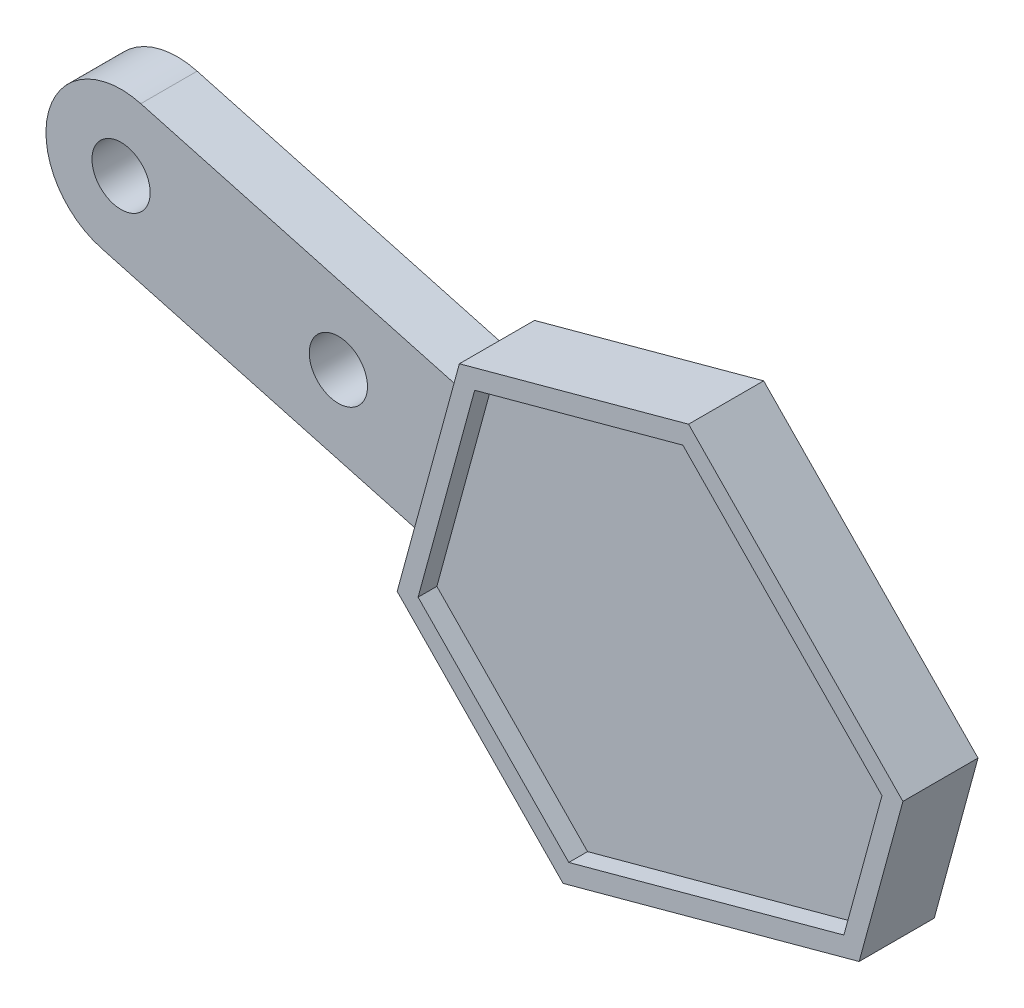
ISO-10303-21;
HEADER;
FILE_DESCRIPTION(('STEP AP214'),'2;1');
FILE_NAME('part.step','',(''),(''),'','','');
FILE_SCHEMA(('AUTOMOTIVE_DESIGN { 1 0 10303 214 1 1 1 1 }'));
ENDSEC;
DATA;
#1=APPLICATION_CONTEXT('core data for automotive mechanical design processes');
#2=APPLICATION_PROTOCOL_DEFINITION('international standard','automotive_design',2000,#1);
#3=PRODUCT_CONTEXT('',#1,'mechanical');
#4=PRODUCT('Part','Part','',(#3));
#5=PRODUCT_RELATED_PRODUCT_CATEGORY('part','',(#4));
#6=PRODUCT_DEFINITION_FORMATION('','',#4);
#7=PRODUCT_DEFINITION_CONTEXT('part definition',#1,'design');
#8=PRODUCT_DEFINITION('design','',#6,#7);
#9=PRODUCT_DEFINITION_SHAPE('','',#8);
#10=(LENGTH_UNIT() NAMED_UNIT(*) SI_UNIT(.MILLI.,.METRE.));
#11=(NAMED_UNIT(*) PLANE_ANGLE_UNIT() SI_UNIT($,.RADIAN.));
#12=(NAMED_UNIT(*) SI_UNIT($,.STERADIAN.) SOLID_ANGLE_UNIT());
#13=UNCERTAINTY_MEASURE_WITH_UNIT(LENGTH_MEASURE(1.E-05),#10,'distance_accuracy_value','');
#14=(GEOMETRIC_REPRESENTATION_CONTEXT(3) GLOBAL_UNCERTAINTY_ASSIGNED_CONTEXT((#13)) GLOBAL_UNIT_ASSIGNED_CONTEXT((#10,
#11,#12)) REPRESENTATION_CONTEXT('',''));
#15=CARTESIAN_POINT('',(0.,0.,0.));
#16=DIRECTION('',(0.,0.,1.));
#17=DIRECTION('',(1.,0.,0.));
#18=AXIS2_PLACEMENT_3D('',#15,#16,#17);
#19=CARTESIAN_POINT('',(38.1207531360918,-10.3903817993219,3.));
#20=DIRECTION('',(0.964803560931518,-0.262971650209416,0.));
#21=DIRECTION('',(0.262971650209416,0.964803560931518,0.));
#22=AXIS2_PLACEMENT_3D('',#19,#20,#21);
#23=PLANE('',#22);
#24=DIRECTION('',(-0.262971650209416,-0.964803560931518,0.));
#25=VECTOR('',#24,1.);
#26=CARTESIAN_POINT('',(38.1207531360918,-10.3903817993219,0.));
#27=LINE('',#26,#25);
#28=CARTESIAN_POINT('',(51.127591798776,37.3297593194111,0.));
#29=VERTEX_POINT('',#28);
#30=CARTESIAN_POINT('',(48.7962458042552,28.776400371837,0.));
#31=VERTEX_POINT('',#30);
#32=EDGE_CURVE('E234',#29,#31,#27,.T.);
#33=ORIENTED_EDGE('',*,*,#32,.F.);
#34=DIRECTION('',(0.,0.,-1.));
#35=VECTOR('',#34,1.);
#36=CARTESIAN_POINT('',(51.127591798776,37.3297593194111,3.));
#37=LINE('',#36,#35);
#38=CARTESIAN_POINT('',(51.127591798776,37.3297593194111,4.));
#39=VERTEX_POINT('',#38);
#40=EDGE_CURVE('E283',#39,#29,#37,.T.);
#41=ORIENTED_EDGE('',*,*,#40,.F.);
#42=DIRECTION('',(0.262971650209416,0.964803560931518,0.));
#43=VECTOR('',#42,1.);
#44=CARTESIAN_POINT('',(51.127591798776,37.3297593194111,4.));
#45=LINE('',#44,#43);
#46=CARTESIAN_POINT('',(48.7962458042552,28.776400371837,4.));
#47=VERTEX_POINT('',#46);
#48=EDGE_CURVE('E176',#47,#39,#45,.T.);
#49=ORIENTED_EDGE('',*,*,#48,.F.);
#50=DIRECTION('',(0.,0.,-1.));
#51=VECTOR('',#50,1.);
#52=CARTESIAN_POINT('',(48.7962458042552,28.776400371837,3.));
#53=LINE('',#52,#51);
#54=EDGE_CURVE('E264',#47,#31,#53,.T.);
#55=ORIENTED_EDGE('',*,*,#54,.T.);
#56=EDGE_LOOP('',(#33,#41,#49,#55));
#57=FACE_BOUND('',#56,.T.);
#58=ADVANCED_FACE('F35',(#57),#23,.T.);
#59=CARTESIAN_POINT('',(44.8323643576275,43.7767824762384,3.));
#60=DIRECTION('',(-0.71547962690603,-0.69863359744748,0.));
#61=DIRECTION('',(0.69863359744748,-0.71547962690603,0.));
#62=AXIS2_PLACEMENT_3D('',#59,#60,#61);
#63=PLANE('',#62);
#64=DIRECTION('',(-0.69863359744748,0.71547962690603,0.));
#65=VECTOR('',#64,1.);
#66=CARTESIAN_POINT('',(44.8323643576275,43.7767824762384,0.));
#67=LINE('',#66,#65);
#68=CARTESIAN_POINT('',(39.7087582613538,49.0239331880977,0.));
#69=VERTEX_POINT('',#68);
#70=EDGE_CURVE('E241',#29,#69,#67,.T.);
#71=ORIENTED_EDGE('',*,*,#70,.T.);
#72=DIRECTION('',(0.,0.,-1.));
#73=VECTOR('',#72,1.);
#74=CARTESIAN_POINT('',(39.7087582613538,49.0239331880977,3.));
#75=LINE('',#74,#73);
#76=CARTESIAN_POINT('',(39.7087582613538,49.0239331880977,4.));
#77=VERTEX_POINT('',#76);
#78=EDGE_CURVE('E281',#77,#69,#75,.T.);
#79=ORIENTED_EDGE('',*,*,#78,.F.);
#80=DIRECTION('',(-0.69863359744748,0.715479626906031,0.));
#81=VECTOR('',#80,1.);
#82=CARTESIAN_POINT('',(51.127591798776,37.3297593194111,4.));
#83=LINE('',#82,#81);
#84=EDGE_CURVE('E219',#39,#77,#83,.T.);
#85=ORIENTED_EDGE('',*,*,#84,.F.);
#86=ORIENTED_EDGE('',*,*,#40,.T.);
#87=EDGE_LOOP('',(#71,#79,#85,#86));
#88=FACE_BOUND('',#87,.T.);
#89=ADVANCED_FACE('F317',(#88),#63,.F.);
#90=CARTESIAN_POINT('',(-9.67375651287494,35.6080056345547,3.));
#91=DIRECTION('',(-0.262170893566225,0.965021462231119,0.));
#92=DIRECTION('',(-0.965021462231119,-0.262170893566225,0.));
#93=AXIS2_PLACEMENT_3D('',#90,#91,#92);
#94=PLANE('',#93);
#95=DIRECTION('',(0.965021462231119,0.262170893566225,0.));
#96=VECTOR('',#95,1.);
#97=CARTESIAN_POINT('',(-9.67375651287494,35.6080056345547,0.));
#98=LINE('',#97,#96);
#99=CARTESIAN_POINT('',(27.4988774001279,45.7068304074778,0.));
#100=VERTEX_POINT('',#99);
#101=EDGE_CURVE('E244',#100,#69,#98,.T.);
#102=ORIENTED_EDGE('',*,*,#101,.F.);
#103=DIRECTION('',(0.,0.,-1.));
#104=VECTOR('',#103,1.);
#105=CARTESIAN_POINT('',(27.4988774001279,45.7068304074778,3.));
#106=LINE('',#105,#104);
#107=CARTESIAN_POINT('',(27.4988774001279,45.7068304074778,4.));
#108=VERTEX_POINT('',#107);
#109=EDGE_CURVE('E279',#108,#100,#106,.T.);
#110=ORIENTED_EDGE('',*,*,#109,.F.);
#111=DIRECTION('',(-0.965021462231119,-0.262170893566226,0.));
#112=VECTOR('',#111,1.);
#113=CARTESIAN_POINT('',(27.4988774001279,45.7068304074778,4.));
#114=LINE('',#113,#112);
#115=EDGE_CURVE('E222',#77,#108,#114,.T.);
#116=ORIENTED_EDGE('',*,*,#115,.F.);
#117=ORIENTED_EDGE('',*,*,#78,.T.);
#118=EDGE_LOOP('',(#102,#110,#116,#117));
#119=FACE_BOUND('',#118,.T.);
#120=ADVANCED_FACE('F313',(#119),#94,.T.);
#121=CARTESIAN_POINT('',(12.8930522662611,47.302675888672,3.));
#122=DIRECTION('',(0.262971650209409,0.964803560931519,0.));
#123=DIRECTION('',(-0.964803560931519,0.262971650209409,0.));
#124=AXIS2_PLACEMENT_3D('',#121,#122,#123);
#125=PLANE('',#124);
#126=DIRECTION('',(0.964803560931519,-0.262971650209409,0.));
#127=VECTOR('',#126,1.);
#128=CARTESIAN_POINT('',(12.8930522662611,47.302675888672,0.));
#129=LINE('',#128,#127);
#130=CARTESIAN_POINT('',(9.52725228229794,48.2200750483548,0.));
#131=VERTEX_POINT('',#130);
#132=CARTESIAN_POINT('',(26.8937163790653,43.4865853445854,0.));
#133=VERTEX_POINT('',#132);
#134=EDGE_CURVE('E250',#131,#133,#129,.T.);
#135=ORIENTED_EDGE('',*,*,#134,.F.);
#136=DIRECTION('',(0.,0.,-1.));
#137=VECTOR('',#136,1.);
#138=CARTESIAN_POINT('',(9.52725228229794,48.2200750483548,3.));
#139=LINE('',#138,#137);
#140=CARTESIAN_POINT('',(9.52725228229794,48.2200750483548,3.));
#141=VERTEX_POINT('',#140);
#142=EDGE_CURVE('E60',#131,#141,#139,.F.);
#143=ORIENTED_EDGE('',*,*,#142,.T.);
#144=DIRECTION('',(0.964803560931519,-0.262971650209409,0.));
#145=VECTOR('',#144,1.);
#146=CARTESIAN_POINT('',(12.8930522662611,47.302675888672,3.));
#147=LINE('',#146,#145);
#148=CARTESIAN_POINT('',(26.8937163790653,43.4865853445854,3.));
#149=VERTEX_POINT('',#148);
#150=EDGE_CURVE('E238',#141,#149,#147,.T.);
#151=ORIENTED_EDGE('',*,*,#150,.T.);
#152=DIRECTION('',(0.,0.,-1.));
#153=VECTOR('',#152,1.);
#154=CARTESIAN_POINT('',(26.8937163790653,43.4865853445854,3.));
#155=LINE('',#154,#153);
#156=EDGE_CURVE('E278',#149,#133,#155,.T.);
#157=ORIENTED_EDGE('',*,*,#156,.T.);
#158=EDGE_LOOP('',(#135,#143,#151,#157));
#159=FACE_BOUND('',#158,.T.);
#160=ADVANCED_FACE('F302',(#159),#125,.T.);
#161=CARTESIAN_POINT('',(8.47536568146036,44.3608608046289,3.));
#162=DIRECTION('',(0.,0.,-1.));
#163=DIRECTION('',(-1.,0.,0.));
#164=AXIS2_PLACEMENT_3D('',#161,#162,#163);
#165=CYLINDRICAL_SURFACE('',#164,4.);
#166=CARTESIAN_POINT('',(8.47536568146036,44.3608608046289,0.));
#167=DIRECTION('',(0.,0.,1.));
#168=DIRECTION('',(1.,0.,0.));
#169=AXIS2_PLACEMENT_3D('',#166,#167,#168);
#170=CIRCLE('',#169,4.);
#171=CARTESIAN_POINT('',(4.61615143773429,45.4127474054666,0.));
#172=VERTEX_POINT('',#171);
#173=CARTESIAN_POINT('',(7.4234790806227,40.5016465609029,0.));
#174=VERTEX_POINT('',#173);
#175=EDGE_CURVE('E252',#172,#174,#170,.T.);
#176=ORIENTED_EDGE('',*,*,#175,.T.);
#177=DIRECTION('',(0.,0.,-1.));
#178=VECTOR('',#177,1.);
#179=CARTESIAN_POINT('',(7.4234790806227,40.5016465609029,3.));
#180=LINE('',#179,#178);
#181=CARTESIAN_POINT('',(7.4234790806227,40.5016465609029,3.));
#182=VERTEX_POINT('',#181);
#183=EDGE_CURVE('E272',#182,#174,#180,.T.);
#184=ORIENTED_EDGE('',*,*,#183,.F.);
#185=CARTESIAN_POINT('',(8.47536568146036,44.3608608046289,3.));
#186=DIRECTION('',(0.,0.,1.));
#187=DIRECTION('',(1.,0.,0.));
#188=AXIS2_PLACEMENT_3D('',#185,#186,#187);
#189=CIRCLE('',#188,4.);
#190=CARTESIAN_POINT('',(4.61615143773429,45.4127474054666,3.));
#191=VERTEX_POINT('',#190);
#192=EDGE_CURVE('E235',#191,#182,#189,.T.);
#193=ORIENTED_EDGE('',*,*,#192,.F.);
#194=DIRECTION('',(0.,0.,-1.));
#195=VECTOR('',#194,1.);
#196=CARTESIAN_POINT('',(4.61615143773429,45.4127474054666,3.));
#197=LINE('',#196,#195);
#198=EDGE_CURVE('E275',#191,#172,#197,.T.);
#199=ORIENTED_EDGE('',*,*,#198,.T.);
#200=EDGE_LOOP('',(#176,#184,#193,#199));
#201=FACE_BOUND('',#200,.T.);
#202=ADVANCED_FACE('F339',(#201),#165,.T.);
#203=CARTESIAN_POINT('',(10.7892790645862,39.5842474012199,3.));
#204=DIRECTION('',(0.262971650209416,0.964803560931518,0.));
#205=DIRECTION('',(-0.964803560931518,0.262971650209416,0.));
#206=AXIS2_PLACEMENT_3D('',#203,#204,#205);
#207=PLANE('',#206);
#208=DIRECTION('',(0.964803560931518,-0.262971650209416,0.));
#209=VECTOR('',#208,1.);
#210=CARTESIAN_POINT('',(10.7892790645862,39.5842474012199,0.));
#211=LINE('',#210,#209);
#212=CARTESIAN_POINT('',(24.78994317739,35.7681568571334,0.));
#213=VERTEX_POINT('',#212);
#214=EDGE_CURVE('E254',#174,#213,#211,.T.);
#215=ORIENTED_EDGE('',*,*,#214,.T.);
#216=DIRECTION('',(0.,0.,-1.));
#217=VECTOR('',#216,1.);
#218=CARTESIAN_POINT('',(24.78994317739,35.7681568571334,3.));
#219=LINE('',#218,#217);
#220=CARTESIAN_POINT('',(24.78994317739,35.7681568571334,3.));
#221=VERTEX_POINT('',#220);
#222=EDGE_CURVE('E271',#221,#213,#219,.T.);
#223=ORIENTED_EDGE('',*,*,#222,.F.);
#224=DIRECTION('',(0.964803560931518,-0.262971650209416,0.));
#225=VECTOR('',#224,1.);
#226=CARTESIAN_POINT('',(10.7892790645862,39.5842474012199,3.));
#227=LINE('',#226,#225);
#228=EDGE_CURVE('E237',#182,#221,#227,.T.);
#229=ORIENTED_EDGE('',*,*,#228,.F.);
#230=ORIENTED_EDGE('',*,*,#183,.T.);
#231=EDGE_LOOP('',(#215,#223,#229,#230));
#232=FACE_BOUND('',#231,.T.);
#233=ADVANCED_FACE('F335',(#232),#207,.F.);
#234=CARTESIAN_POINT('',(14.0006641128039,-3.81609054408653,3.));
#235=DIRECTION('',(0.964803560931518,-0.262971650209416,0.));
#236=DIRECTION('',(0.262971650209416,0.964803560931518,0.));
#237=AXIS2_PLACEMENT_3D('',#234,#235,#236);
#238=PLANE('',#237);
#239=DIRECTION('',(-0.262971650209416,-0.964803560931518,0.));
#240=VECTOR('',#239,1.);
#241=CARTESIAN_POINT('',(14.0006641128039,-3.81609054408653,0.));
#242=LINE('',#241,#240);
#243=CARTESIAN_POINT('',(24.1847821563274,33.547911794241,0.));
#244=VERTEX_POINT('',#243);
#245=EDGE_CURVE('E256',#213,#244,#242,.T.);
#246=ORIENTED_EDGE('',*,*,#245,.T.);
#247=DIRECTION('',(0.,0.,-1.));
#248=VECTOR('',#247,1.);
#249=CARTESIAN_POINT('',(24.1847821563274,33.547911794241,3.));
#250=LINE('',#249,#248);
#251=CARTESIAN_POINT('',(24.1847821563274,33.547911794241,4.));
#252=VERTEX_POINT('',#251);
#253=EDGE_CURVE('E268',#252,#244,#250,.T.);
#254=ORIENTED_EDGE('',*,*,#253,.F.);
#255=DIRECTION('',(-0.262971650209415,-0.964803560931518,0.));
#256=VECTOR('',#255,1.);
#257=CARTESIAN_POINT('',(27.4988774001279,45.7068304074778,4.));
#258=LINE('',#257,#256);
#259=EDGE_CURVE('E225',#108,#252,#258,.T.);
#260=ORIENTED_EDGE('',*,*,#259,.F.);
#261=ORIENTED_EDGE('',*,*,#109,.T.);
#262=DIRECTION('',(-0.262971650209416,-0.964803560931518,0.));
#263=VECTOR('',#262,1.);
#264=CARTESIAN_POINT('',(14.0006641128039,-3.81609054408653,0.));
#265=LINE('',#264,#263);
#266=EDGE_CURVE('E247',#100,#133,#265,.T.);
#267=ORIENTED_EDGE('',*,*,#266,.T.);
#268=ORIENTED_EDGE('',*,*,#156,.F.);
#269=DIRECTION('',(-0.262971650209417,-0.964803560931517,0.));
#270=VECTOR('',#269,1.);
#271=CARTESIAN_POINT('',(24.78994317739,35.7681568571334,3.));
#272=LINE('',#271,#270);
#273=EDGE_CURVE('E11',#149,#221,#272,.T.);
#274=ORIENTED_EDGE('',*,*,#273,.T.);
#275=ORIENTED_EDGE('',*,*,#222,.T.);
#276=EDGE_LOOP('',(#246,#254,#260,#261,#267,#268,#274,#275));
#277=FACE_BOUND('',#276,.T.);
#278=ADVANCED_FACE('F305',(#277),#238,.F.);
#279=CARTESIAN_POINT('',(29.153455828047,28.4577732538788,3.));
#280=DIRECTION('',(0.715593255846183,0.698517209657327,0.));
#281=DIRECTION('',(-0.698517209657327,0.715593255846183,0.));
#282=AXIS2_PLACEMENT_3D('',#279,#280,#281);
#283=PLANE('',#282);
#284=DIRECTION('',(0.698517209657327,-0.715593255846183,0.));
#285=VECTOR('',#284,1.);
#286=CARTESIAN_POINT('',(29.153455828047,28.4577732538788,0.));
#287=LINE('',#286,#285);
#288=CARTESIAN_POINT('',(33.0227326509345,24.4939075664199,0.));
#289=VERTEX_POINT('',#288);
#290=EDGE_CURVE('E258',#244,#289,#287,.T.);
#291=ORIENTED_EDGE('',*,*,#290,.T.);
#292=DIRECTION('',(0.,0.,-1.));
#293=VECTOR('',#292,1.);
#294=CARTESIAN_POINT('',(33.0227326509345,24.4939075664199,3.));
#295=LINE('',#294,#293);
#296=CARTESIAN_POINT('',(33.0227326509345,24.4939075664199,4.));
#297=VERTEX_POINT('',#296);
#298=EDGE_CURVE('E266',#297,#289,#295,.T.);
#299=ORIENTED_EDGE('',*,*,#298,.F.);
#300=DIRECTION('',(0.698517209657328,-0.715593255846183,0.));
#301=VECTOR('',#300,1.);
#302=CARTESIAN_POINT('',(24.1847821563274,33.547911794241,4.));
#303=LINE('',#302,#301);
#304=EDGE_CURVE('E228',#252,#297,#303,.T.);
#305=ORIENTED_EDGE('',*,*,#304,.F.);
#306=ORIENTED_EDGE('',*,*,#253,.T.);
#307=EDGE_LOOP('',(#291,#299,#305,#306));
#308=FACE_BOUND('',#307,.T.);
#309=ADVANCED_FACE('F328',(#308),#283,.F.);
#310=CARTESIAN_POINT('',(-3.92648168155245,14.4622333917053,3.));
#311=DIRECTION('',(0.262013921552175,-0.96506409368127,0.));
#312=DIRECTION('',(0.96506409368127,0.262013921552175,0.));
#313=AXIS2_PLACEMENT_3D('',#310,#311,#312);
#314=PLANE('',#313);
#315=DIRECTION('',(-0.96506409368127,-0.262013921552175,0.));
#316=VECTOR('',#315,1.);
#317=CARTESIAN_POINT('',(-3.92648168155245,14.4622333917053,0.));
#318=LINE('',#317,#316);
#319=EDGE_CURVE('E261',#31,#289,#318,.T.);
#320=ORIENTED_EDGE('',*,*,#319,.F.);
#321=ORIENTED_EDGE('',*,*,#54,.F.);
#322=DIRECTION('',(0.96506409368127,0.262013921552175,0.));
#323=VECTOR('',#322,1.);
#324=CARTESIAN_POINT('',(48.7962458042552,28.776400371837,4.));
#325=LINE('',#324,#323);
#326=EDGE_CURVE('E231',#297,#47,#325,.T.);
#327=ORIENTED_EDGE('',*,*,#326,.F.);
#328=ORIENTED_EDGE('',*,*,#298,.T.);
#329=EDGE_LOOP('',(#320,#321,#327,#328));
#330=FACE_BOUND('',#329,.T.);
#331=ADVANCED_FACE('F324',(#330),#314,.T.);
#332=CARTESIAN_POINT('',(0.,0.,3.));
#333=DIRECTION('',(0.,0.,1.));
#334=DIRECTION('',(1.,0.,0.));
#335=AXIS2_PLACEMENT_3D('',#332,#333,#334);
#336=PLANE('',#335);
#337=CARTESIAN_POINT('',(20.0530084126385,41.2052010021159,3.));
#338=DIRECTION('',(0.,0.,1.));
#339=DIRECTION('',(1.,0.,0.));
#340=AXIS2_PLACEMENT_3D('',#337,#338,#339);
#341=CIRCLE('',#340,1.55);
#342=CARTESIAN_POINT('',(21.6030084126385,41.2052010021159,3.));
#343=VERTEX_POINT('',#342);
#344=EDGE_CURVE('E500',#343,#343,#341,.T.);
#345=ORIENTED_EDGE('',*,*,#344,.F.);
#346=EDGE_LOOP('',(#345));
#347=FACE_BOUND('',#346,.T.);
#348=CARTESIAN_POINT('',(8.47536568146031,44.3608608046287,3.));
#349=DIRECTION('',(0.,0.,1.));
#350=DIRECTION('',(1.,0.,0.));
#351=AXIS2_PLACEMENT_3D('',#348,#349,#350);
#352=CIRCLE('',#351,1.55);
#353=CARTESIAN_POINT('',(10.0253656814603,44.3608608046287,3.));
#354=VERTEX_POINT('',#353);
#355=EDGE_CURVE('E504',#354,#354,#352,.T.);
#356=ORIENTED_EDGE('',*,*,#355,.F.);
#357=EDGE_LOOP('',(#356));
#358=FACE_BOUND('',#357,.T.);
#359=ORIENTED_EDGE('',*,*,#273,.F.);
#360=ORIENTED_EDGE('',*,*,#150,.F.);
#361=CARTESIAN_POINT('',(8.47536568146031,44.3608608046287,3.));
#362=DIRECTION('',(0.,0.,1.));
#363=DIRECTION('',(1.,0.,0.));
#364=AXIS2_PLACEMENT_3D('',#361,#362,#363);
#365=CIRCLE('',#364,4.);
#366=EDGE_CURVE('E44',#141,#191,#365,.T.);
#367=ORIENTED_EDGE('',*,*,#366,.T.);
#368=ORIENTED_EDGE('',*,*,#192,.T.);
#369=ORIENTED_EDGE('',*,*,#228,.T.);
#370=EDGE_LOOP('',(#359,#360,#367,#368,#369));
#371=FACE_BOUND('',#370,.T.);
#372=ADVANCED_FACE('F344',(#347,#358,#371),#336,.T.);
#373=CARTESIAN_POINT('',(0.,0.,0.));
#374=DIRECTION('',(0.,0.,1.));
#375=DIRECTION('',(1.,0.,0.));
#376=AXIS2_PLACEMENT_3D('',#373,#374,#375);
#377=PLANE('',#376);
#378=CARTESIAN_POINT('',(20.0530084126385,41.2052010021159,0.));
#379=DIRECTION('',(0.,0.,1.));
#380=DIRECTION('',(1.,0.,0.));
#381=AXIS2_PLACEMENT_3D('',#378,#379,#380);
#382=CIRCLE('',#381,1.55);
#383=CARTESIAN_POINT('',(21.6030084126385,41.2052010021159,0.));
#384=VERTEX_POINT('',#383);
#385=EDGE_CURVE('E503',#384,#384,#382,.F.);
#386=ORIENTED_EDGE('',*,*,#385,.F.);
#387=EDGE_LOOP('',(#386));
#388=FACE_BOUND('',#387,.T.);
#389=CARTESIAN_POINT('',(8.47536568146031,44.3608608046287,0.));
#390=DIRECTION('',(0.,0.,1.));
#391=DIRECTION('',(1.,0.,0.));
#392=AXIS2_PLACEMENT_3D('',#389,#390,#391);
#393=CIRCLE('',#392,1.55);
#394=CARTESIAN_POINT('',(10.0253656814603,44.3608608046287,0.));
#395=VERTEX_POINT('',#394);
#396=EDGE_CURVE('E196',#395,#395,#393,.F.);
#397=ORIENTED_EDGE('',*,*,#396,.F.);
#398=EDGE_LOOP('',(#397));
#399=FACE_BOUND('',#398,.T.);
#400=ORIENTED_EDGE('',*,*,#175,.F.);
#401=CARTESIAN_POINT('',(8.47536568146031,44.3608608046287,0.));
#402=DIRECTION('',(0.,0.,1.));
#403=DIRECTION('',(1.,0.,0.));
#404=AXIS2_PLACEMENT_3D('',#401,#402,#403);
#405=CIRCLE('',#404,4.);
#406=EDGE_CURVE('E285',#172,#131,#405,.F.);
#407=ORIENTED_EDGE('',*,*,#406,.T.);
#408=ORIENTED_EDGE('',*,*,#134,.T.);
#409=ORIENTED_EDGE('',*,*,#266,.F.);
#410=ORIENTED_EDGE('',*,*,#101,.T.);
#411=ORIENTED_EDGE('',*,*,#70,.F.);
#412=ORIENTED_EDGE('',*,*,#32,.T.);
#413=ORIENTED_EDGE('',*,*,#319,.T.);
#414=ORIENTED_EDGE('',*,*,#290,.F.);
#415=ORIENTED_EDGE('',*,*,#245,.F.);
#416=ORIENTED_EDGE('',*,*,#214,.F.);
#417=EDGE_LOOP('',(#400,#407,#408,#409,#410,#411,#412,#413,#414,#415,#416));
#418=FACE_BOUND('',#417,.T.);
#419=ADVANCED_FACE('F310',(#388,#399,#418),#377,.F.);
#420=CARTESIAN_POINT('',(8.47536568146031,44.3608608046287,3.));
#421=DIRECTION('',(0.,0.,1.));
#422=DIRECTION('',(1.,0.,0.));
#423=AXIS2_PLACEMENT_3D('',#420,#421,#422);
#424=CYLINDRICAL_SURFACE('',#423,4.);
#425=ORIENTED_EDGE('',*,*,#366,.F.);
#426=ORIENTED_EDGE('',*,*,#142,.F.);
#427=ORIENTED_EDGE('',*,*,#406,.F.);
#428=ORIENTED_EDGE('',*,*,#198,.F.);
#429=EDGE_LOOP('',(#425,#426,#427,#428));
#430=FACE_BOUND('',#429,.T.);
#431=ADVANCED_FACE('F37',(#430),#424,.T.);
#432=CARTESIAN_POINT('',(0.,0.,4.));
#433=DIRECTION('',(0.,0.,-1.));
#434=DIRECTION('',(-1.,0.,0.));
#435=AXIS2_PLACEMENT_3D('',#432,#433,#434);
#436=PLANE('',#435);
#437=ORIENTED_EDGE('',*,*,#48,.T.);
#438=ORIENTED_EDGE('',*,*,#84,.T.);
#439=ORIENTED_EDGE('',*,*,#115,.T.);
#440=ORIENTED_EDGE('',*,*,#259,.T.);
#441=ORIENTED_EDGE('',*,*,#304,.T.);
#442=ORIENTED_EDGE('',*,*,#326,.T.);
#443=EDGE_LOOP('',(#437,#438,#439,#440,#441,#442));
#444=FACE_BOUND('',#443,.T.);
#445=DIRECTION('',(0.96506409368127,0.262013921552175,0.));
#446=VECTOR('',#445,1.);
#447=CARTESIAN_POINT('',(33.3278407466464,25.6129447119584,4.));
#448=LINE('',#447,#446);
#449=CARTESIAN_POINT('',(33.3278407466464,25.6129447119584,4.));
#450=VERTEX_POINT('',#449);
#451=CARTESIAN_POINT('',(47.9819376602015,29.5915171448835,4.));
#452=VERTEX_POINT('',#451);
#453=EDGE_CURVE('E160',#450,#452,#448,.T.);
#454=ORIENTED_EDGE('',*,*,#453,.F.);
#455=DIRECTION('',(0.698517209657327,-0.715593255846184,0.));
#456=VECTOR('',#455,1.);
#457=CARTESIAN_POINT('',(25.300052743626,33.8369811063409,4.));
#458=LINE('',#457,#456);
#459=CARTESIAN_POINT('',(25.300052743626,33.8369811063409,4.));
#460=VERTEX_POINT('',#459);
#461=EDGE_CURVE('E192',#460,#450,#458,.T.);
#462=ORIENTED_EDGE('',*,*,#461,.F.);
#463=DIRECTION('',(-0.262971650209416,-0.964803560931518,0.));
#464=VECTOR('',#463,1.);
#465=CARTESIAN_POINT('',(28.3132139346924,44.8918177949591,4.));
#466=LINE('',#465,#464);
#467=CARTESIAN_POINT('',(28.3132139346924,44.8918177949591,4.));
#468=VERTEX_POINT('',#467);
#469=EDGE_CURVE('E189',#468,#460,#466,.T.);
#470=ORIENTED_EDGE('',*,*,#469,.F.);
#471=DIRECTION('',(-0.965021462231119,-0.262170893566225,0.));
#472=VECTOR('',#471,1.);
#473=CARTESIAN_POINT('',(39.4038321901204,47.9048464290633,4.));
#474=LINE('',#473,#472);
#475=CARTESIAN_POINT('',(39.4038321901204,47.9048464290633,4.));
#476=VERTEX_POINT('',#475);
#477=EDGE_CURVE('E184',#476,#468,#474,.T.);
#478=ORIENTED_EDGE('',*,*,#477,.F.);
#479=DIRECTION('',(-0.69863359744748,0.71547962690603,0.));
#480=VECTOR('',#479,1.);
#481=CARTESIAN_POINT('',(50.0122928209666,37.0405858467833,4.));
#482=LINE('',#481,#480);
#483=CARTESIAN_POINT('',(50.0122928209666,37.0405858467833,4.));
#484=VERTEX_POINT('',#483);
#485=EDGE_CURVE('E182',#484,#476,#482,.T.);
#486=ORIENTED_EDGE('',*,*,#485,.F.);
#487=DIRECTION('',(0.262971650209416,0.964803560931518,0.));
#488=VECTOR('',#487,1.);
#489=CARTESIAN_POINT('',(47.9819376602015,29.5915171448835,4.));
#490=LINE('',#489,#488);
#491=EDGE_CURVE('E169',#452,#484,#490,.T.);
#492=ORIENTED_EDGE('',*,*,#491,.F.);
#493=EDGE_LOOP('',(#454,#462,#470,#478,#486,#492));
#494=FACE_BOUND('',#493,.T.);
#495=ADVANCED_FACE('F180',(#444,#494),#436,.F.);
#496=CARTESIAN_POINT('',(33.3278407466464,25.6129447119584,4.));
#497=DIRECTION('',(-0.262013921552175,0.96506409368127,0.));
#498=DIRECTION('',(-0.96506409368127,-0.262013921552175,0.));
#499=AXIS2_PLACEMENT_3D('',#496,#497,#498);
#500=PLANE('',#499);
#501=DIRECTION('',(0.96506409368127,0.262013921552175,0.));
#502=VECTOR('',#501,1.);
#503=CARTESIAN_POINT('',(33.3278407466464,25.6129447119584,3.));
#504=LINE('',#503,#502);
#505=CARTESIAN_POINT('',(33.3278407466464,25.6129447119584,3.));
#506=VERTEX_POINT('',#505);
#507=CARTESIAN_POINT('',(47.9819376602015,29.5915171448835,3.));
#508=VERTEX_POINT('',#507);
#509=EDGE_CURVE('E194',#506,#508,#504,.T.);
#510=ORIENTED_EDGE('',*,*,#509,.F.);
#511=DIRECTION('',(0.,0.,-1.));
#512=VECTOR('',#511,1.);
#513=CARTESIAN_POINT('',(33.3278407466464,25.6129447119584,4.));
#514=LINE('',#513,#512);
#515=EDGE_CURVE('E165',#450,#506,#514,.T.);
#516=ORIENTED_EDGE('',*,*,#515,.F.);
#517=ORIENTED_EDGE('',*,*,#453,.T.);
#518=DIRECTION('',(0.,0.,-1.));
#519=VECTOR('',#518,1.);
#520=CARTESIAN_POINT('',(47.9819376602015,29.5915171448835,4.));
#521=LINE('',#520,#519);
#522=EDGE_CURVE('E163',#452,#508,#521,.T.);
#523=ORIENTED_EDGE('',*,*,#522,.T.);
#524=EDGE_LOOP('',(#510,#516,#517,#523));
#525=FACE_BOUND('',#524,.T.);
#526=ADVANCED_FACE('F162',(#525),#500,.T.);
#527=CARTESIAN_POINT('',(47.9819376602015,29.5915171448835,4.));
#528=DIRECTION('',(-0.964803560931518,0.262971650209416,0.));
#529=DIRECTION('',(-0.262971650209416,-0.964803560931518,0.));
#530=AXIS2_PLACEMENT_3D('',#527,#528,#529);
#531=PLANE('',#530);
#532=DIRECTION('',(0.262971650209416,0.964803560931518,0.));
#533=VECTOR('',#532,1.);
#534=CARTESIAN_POINT('',(47.9819376602015,29.5915171448835,3.));
#535=LINE('',#534,#533);
#536=CARTESIAN_POINT('',(50.0122928209666,37.0405858467833,3.));
#537=VERTEX_POINT('',#536);
#538=EDGE_CURVE('E175',#508,#537,#535,.T.);
#539=ORIENTED_EDGE('',*,*,#538,.F.);
#540=ORIENTED_EDGE('',*,*,#522,.F.);
#541=ORIENTED_EDGE('',*,*,#491,.T.);
#542=DIRECTION('',(0.,0.,-1.));
#543=VECTOR('',#542,1.);
#544=CARTESIAN_POINT('',(50.0122928209666,37.0405858467833,4.));
#545=LINE('',#544,#543);
#546=EDGE_CURVE('E177',#484,#537,#545,.T.);
#547=ORIENTED_EDGE('',*,*,#546,.T.);
#548=EDGE_LOOP('',(#539,#540,#541,#547));
#549=FACE_BOUND('',#548,.T.);
#550=ADVANCED_FACE('F172',(#549),#531,.T.);
#551=CARTESIAN_POINT('',(50.0122928209666,37.0405858467833,4.));
#552=DIRECTION('',(-0.71547962690603,-0.69863359744748,0.));
#553=DIRECTION('',(0.69863359744748,-0.71547962690603,0.));
#554=AXIS2_PLACEMENT_3D('',#551,#552,#553);
#555=PLANE('',#554);
#556=DIRECTION('',(-0.69863359744748,0.71547962690603,0.));
#557=VECTOR('',#556,1.);
#558=CARTESIAN_POINT('',(50.0122928209666,37.0405858467833,3.));
#559=LINE('',#558,#557);
#560=CARTESIAN_POINT('',(39.4038321901204,47.9048464290633,3.));
#561=VERTEX_POINT('',#560);
#562=EDGE_CURVE('E198',#537,#561,#559,.T.);
#563=ORIENTED_EDGE('',*,*,#562,.F.);
#564=ORIENTED_EDGE('',*,*,#546,.F.);
#565=ORIENTED_EDGE('',*,*,#485,.T.);
#566=DIRECTION('',(0.,0.,-1.));
#567=VECTOR('',#566,1.);
#568=CARTESIAN_POINT('',(39.4038321901204,47.9048464290633,4.));
#569=LINE('',#568,#567);
#570=EDGE_CURVE('E214',#476,#561,#569,.T.);
#571=ORIENTED_EDGE('',*,*,#570,.T.);
#572=EDGE_LOOP('',(#563,#564,#565,#571));
#573=FACE_BOUND('',#572,.T.);
#574=ADVANCED_FACE('F414',(#573),#555,.T.);
#575=CARTESIAN_POINT('',(39.4038321901204,47.9048464290633,4.));
#576=DIRECTION('',(0.262170893566225,-0.965021462231119,0.));
#577=DIRECTION('',(0.965021462231119,0.262170893566226,0.));
#578=AXIS2_PLACEMENT_3D('',#575,#576,#577);
#579=PLANE('',#578);
#580=DIRECTION('',(-0.965021462231119,-0.262170893566225,0.));
#581=VECTOR('',#580,1.);
#582=CARTESIAN_POINT('',(39.4038321901204,47.9048464290633,3.));
#583=LINE('',#582,#581);
#584=CARTESIAN_POINT('',(28.3132139346924,44.8918177949591,3.));
#585=VERTEX_POINT('',#584);
#586=EDGE_CURVE('E201',#561,#585,#583,.T.);
#587=ORIENTED_EDGE('',*,*,#586,.F.);
#588=ORIENTED_EDGE('',*,*,#570,.F.);
#589=ORIENTED_EDGE('',*,*,#477,.T.);
#590=DIRECTION('',(0.,0.,-1.));
#591=VECTOR('',#590,1.);
#592=CARTESIAN_POINT('',(28.3132139346924,44.8918177949591,4.));
#593=LINE('',#592,#591);
#594=EDGE_CURVE('E211',#468,#585,#593,.T.);
#595=ORIENTED_EDGE('',*,*,#594,.T.);
#596=EDGE_LOOP('',(#587,#588,#589,#595));
#597=FACE_BOUND('',#596,.T.);
#598=ADVANCED_FACE('F423',(#597),#579,.T.);
#599=CARTESIAN_POINT('',(25.7547467383215,35.505185206924,4.));
#600=DIRECTION('',(0.964803560931517,-0.262971650209418,0.));
#601=DIRECTION('',(0.262971650209418,0.964803560931517,0.));
#602=AXIS2_PLACEMENT_3D('',#599,#600,#601);
#603=PLANE('',#602);
#604=DIRECTION('',(-0.262971650209418,-0.964803560931517,0.));
#605=VECTOR('',#604,1.);
#606=CARTESIAN_POINT('',(25.7547467383215,35.505185206924,3.));
#607=LINE('',#606,#605);
#608=CARTESIAN_POINT('',(25.300052743626,33.8369811063409,3.));
#609=VERTEX_POINT('',#608);
#610=EDGE_CURVE('E204',#585,#609,#607,.T.);
#611=ORIENTED_EDGE('',*,*,#610,.F.);
#612=ORIENTED_EDGE('',*,*,#594,.F.);
#613=ORIENTED_EDGE('',*,*,#469,.T.);
#614=DIRECTION('',(0.,0.,-1.));
#615=VECTOR('',#614,1.);
#616=CARTESIAN_POINT('',(25.300052743626,33.8369811063409,4.));
#617=LINE('',#616,#615);
#618=EDGE_CURVE('E209',#460,#609,#617,.T.);
#619=ORIENTED_EDGE('',*,*,#618,.T.);
#620=EDGE_LOOP('',(#611,#612,#613,#619));
#621=FACE_BOUND('',#620,.T.);
#622=ADVANCED_FACE('F433',(#621),#603,.T.);
#623=CARTESIAN_POINT('',(25.300052743626,33.8369811063409,4.));
#624=DIRECTION('',(0.715593255846184,0.698517209657327,0.));
#625=DIRECTION('',(-0.698517209657327,0.715593255846184,0.));
#626=AXIS2_PLACEMENT_3D('',#623,#624,#625);
#627=PLANE('',#626);
#628=DIRECTION('',(0.698517209657327,-0.715593255846184,0.));
#629=VECTOR('',#628,1.);
#630=CARTESIAN_POINT('',(25.300052743626,33.8369811063409,3.));
#631=LINE('',#630,#629);
#632=EDGE_CURVE('E52',#609,#506,#631,.T.);
#633=ORIENTED_EDGE('',*,*,#632,.F.);
#634=ORIENTED_EDGE('',*,*,#618,.F.);
#635=ORIENTED_EDGE('',*,*,#461,.T.);
#636=ORIENTED_EDGE('',*,*,#515,.T.);
#637=EDGE_LOOP('',(#633,#634,#635,#636));
#638=FACE_BOUND('',#637,.T.);
#639=ADVANCED_FACE('F361',(#638),#627,.T.);
#640=ORIENTED_EDGE('',*,*,#610,.T.);
#641=ORIENTED_EDGE('',*,*,#632,.T.);
#642=ORIENTED_EDGE('',*,*,#509,.T.);
#643=ORIENTED_EDGE('',*,*,#538,.T.);
#644=ORIENTED_EDGE('',*,*,#562,.T.);
#645=ORIENTED_EDGE('',*,*,#586,.T.);
#646=EDGE_LOOP('',(#640,#641,#642,#643,#644,#645));
#647=FACE_BOUND('',#646,.T.);
#648=ADVANCED_FACE('F348',(#647),#336,.T.);
#649=CARTESIAN_POINT('',(8.47536568146031,44.3608608046287,-0.00102499999999998));
#650=DIRECTION('',(0.,0.,1.));
#651=DIRECTION('',(1.,0.,0.));
#652=AXIS2_PLACEMENT_3D('',#649,#650,#651);
#653=CYLINDRICAL_SURFACE('',#652,1.55);
#654=ORIENTED_EDGE('',*,*,#355,.T.);
#655=EDGE_LOOP('',(#654));
#656=FACE_BOUND('',#655,.T.);
#657=ORIENTED_EDGE('',*,*,#396,.T.);
#658=EDGE_LOOP('',(#657));
#659=FACE_BOUND('',#658,.T.);
#660=ADVANCED_FACE('F360',(#656,#659),#653,.F.);
#661=CARTESIAN_POINT('',(20.0530084126385,41.2052010021159,-0.00102499999999998));
#662=DIRECTION('',(0.,0.,1.));
#663=DIRECTION('',(1.,0.,0.));
#664=AXIS2_PLACEMENT_3D('',#661,#662,#663);
#665=CYLINDRICAL_SURFACE('',#664,1.55);
#666=ORIENTED_EDGE('',*,*,#344,.T.);
#667=EDGE_LOOP('',(#666));
#668=FACE_BOUND('',#667,.T.);
#669=ORIENTED_EDGE('',*,*,#385,.T.);
#670=EDGE_LOOP('',(#669));
#671=FACE_BOUND('',#670,.T.);
#672=ADVANCED_FACE('F484',(#668,#671),#665,.F.);
#673=CLOSED_SHELL('',(#58,#89,#120,#160,#202,#233,#278,#309,#331,#372,#419,#431,#495,#526,#550,
#574,#598,#622,#639,#648,#660,#672));
#674=MANIFOLD_SOLID_BREP('B2',#673);
#675=ADVANCED_BREP_SHAPE_REPRESENTATION('',(#18,#674),#14);
#676=SHAPE_DEFINITION_REPRESENTATION(#9,#675);
ENDSEC;
END-ISO-10303-21;
